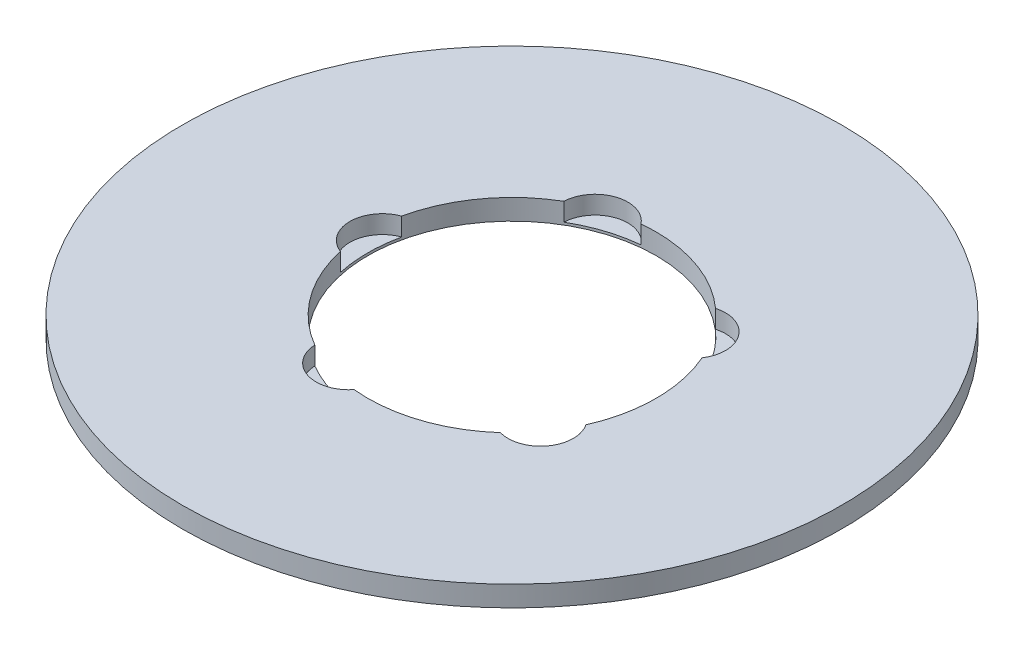
ISO-10303-21;
HEADER;
FILE_DESCRIPTION(('STEP AP214'),'2;1');
FILE_NAME('part.step','',(''),(''),'','','');
FILE_SCHEMA(('AUTOMOTIVE_DESIGN { 1 0 10303 214 1 1 1 1 }'));
ENDSEC;
DATA;
#1=APPLICATION_CONTEXT('core data for automotive mechanical design processes');
#2=APPLICATION_PROTOCOL_DEFINITION('international standard','automotive_design',2000,#1);
#3=PRODUCT_CONTEXT('',#1,'mechanical');
#4=PRODUCT('Part','Part','',(#3));
#5=PRODUCT_RELATED_PRODUCT_CATEGORY('part','',(#4));
#6=PRODUCT_DEFINITION_FORMATION('','',#4);
#7=PRODUCT_DEFINITION_CONTEXT('part definition',#1,'design');
#8=PRODUCT_DEFINITION('design','',#6,#7);
#9=PRODUCT_DEFINITION_SHAPE('','',#8);
#10=(LENGTH_UNIT() NAMED_UNIT(*) SI_UNIT(.MILLI.,.METRE.));
#11=(NAMED_UNIT(*) PLANE_ANGLE_UNIT() SI_UNIT($,.RADIAN.));
#12=(NAMED_UNIT(*) SI_UNIT($,.STERADIAN.) SOLID_ANGLE_UNIT());
#13=UNCERTAINTY_MEASURE_WITH_UNIT(LENGTH_MEASURE(1.E-05),#10,'distance_accuracy_value','');
#14=(GEOMETRIC_REPRESENTATION_CONTEXT(3) GLOBAL_UNCERTAINTY_ASSIGNED_CONTEXT((#13)) GLOBAL_UNIT_ASSIGNED_CONTEXT((#10,
#11,#12)) REPRESENTATION_CONTEXT('',''));
#15=CARTESIAN_POINT('',(0.,0.,0.));
#16=DIRECTION('',(0.,0.,1.));
#17=DIRECTION('',(1.,0.,0.));
#18=AXIS2_PLACEMENT_3D('',#15,#16,#17);
#19=CARTESIAN_POINT('',(0.,5.,0.));
#20=DIRECTION('',(0.,-1.,0.));
#21=DIRECTION('',(0.,0.,-1.));
#22=AXIS2_PLACEMENT_3D('',#19,#20,#21);
#23=CYLINDRICAL_SURFACE('',#22,80.);
#24=CARTESIAN_POINT('',(0.,5.,0.));
#25=DIRECTION('',(0.,1.,0.));
#26=DIRECTION('',(0.,0.,1.));
#27=AXIS2_PLACEMENT_3D('',#24,#25,#26);
#28=CIRCLE('',#27,80.);
#29=CARTESIAN_POINT('',(0.,5.,80.));
#30=VERTEX_POINT('',#29);
#31=EDGE_CURVE('E151',#30,#30,#28,.T.);
#32=ORIENTED_EDGE('',*,*,#31,.F.);
#33=EDGE_LOOP('',(#32));
#34=FACE_BOUND('',#33,.T.);
#35=CARTESIAN_POINT('',(0.,0.,0.));
#36=DIRECTION('',(0.,1.,0.));
#37=DIRECTION('',(0.,0.,1.));
#38=AXIS2_PLACEMENT_3D('',#35,#36,#37);
#39=CIRCLE('',#38,80.);
#40=CARTESIAN_POINT('',(0.,0.,80.));
#41=VERTEX_POINT('',#40);
#42=EDGE_CURVE('E150',#41,#41,#39,.T.);
#43=ORIENTED_EDGE('',*,*,#42,.T.);
#44=EDGE_LOOP('',(#43));
#45=FACE_BOUND('',#44,.T.);
#46=ADVANCED_FACE('F39',(#34,#45),#23,.T.);
#47=CARTESIAN_POINT('',(0.,5.,0.));
#48=DIRECTION('',(0.,1.,0.));
#49=DIRECTION('',(0.,0.,1.));
#50=AXIS2_PLACEMENT_3D('',#47,#48,#49);
#51=PLANE('',#50);
#52=CARTESIAN_POINT('',(-9.71646132065344,5.,-29.904193046174));
#53=DIRECTION('',(0.,1.,0.));
#54=DIRECTION('',(-0.95105651629515,0.,0.309016994374958));
#55=AXIS2_PLACEMENT_3D('',#52,#53,#54);
#56=CIRCLE('',#55,7.92707495473385);
#57=CARTESIAN_POINT('',(-3.50118381639631,5.,-34.8244413003828));
#58=VERTEX_POINT('',#57);
#59=CARTESIAN_POINT('',(-17.6367758077954,5.,-30.2315090444649));
#60=VERTEX_POINT('',#59);
#61=EDGE_CURVE('E196',#58,#60,#56,.T.);
#62=ORIENTED_EDGE('',*,*,#61,.F.);
#63=CARTESIAN_POINT('',(0.,5.,0.));
#64=DIRECTION('',(0.,1.,0.));
#65=DIRECTION('',(0.,0.,1.));
#66=AXIS2_PLACEMENT_3D('',#63,#64,#65);
#67=CIRCLE('',#66,35.);
#68=CARTESIAN_POINT('',(23.3018102235845,5.,-26.1156206187801));
#69=VERTEX_POINT('',#68);
#70=EDGE_CURVE('E156',#69,#58,#67,.T.);
#71=ORIENTED_EDGE('',*,*,#70,.F.);
#72=CARTESIAN_POINT('',(25.4380259878433,5.,-18.4818077086741));
#73=DIRECTION('',(0.,1.,0.));
#74=DIRECTION('',(-0.58778525229248,0.,-0.809016994374942));
#75=AXIS2_PLACEMENT_3D('',#72,#73,#74);
#76=CIRCLE('',#75,7.92707495473385);
#77=CARTESIAN_POINT('',(32.0380865253701,5.,-14.0911678647618));
#78=VERTEX_POINT('',#77);
#79=EDGE_CURVE('E254',#78,#69,#76,.T.);
#80=ORIENTED_EDGE('',*,*,#79,.F.);
#81=CARTESIAN_POINT('',(32.0380865253704,5.,14.0911678647614));
#82=VERTEX_POINT('',#81);
#83=EDGE_CURVE('E153',#82,#78,#67,.T.);
#84=ORIENTED_EDGE('',*,*,#83,.F.);
#85=CARTESIAN_POINT('',(25.4380259878436,5.,18.4818077086737));
#86=DIRECTION('',(0.,1.,0.));
#87=DIRECTION('',(0.587785252292469,0.,-0.809016994374951));
#88=AXIS2_PLACEMENT_3D('',#85,#86,#87);
#89=CIRCLE('',#88,7.92707495473385);
#90=CARTESIAN_POINT('',(23.3018102235849,5.,26.1156206187798));
#91=VERTEX_POINT('',#90);
#92=EDGE_CURVE('E248',#91,#82,#89,.T.);
#93=ORIENTED_EDGE('',*,*,#92,.F.);
#94=CARTESIAN_POINT('',(-3.50118381639581,5.,34.8244413003828));
#95=VERTEX_POINT('',#94);
#96=EDGE_CURVE('E140',#95,#91,#67,.T.);
#97=ORIENTED_EDGE('',*,*,#96,.F.);
#98=CARTESIAN_POINT('',(-9.71646132065301,5.,29.9041930461742));
#99=DIRECTION('',(0.,1.,0.));
#100=DIRECTION('',(0.951056516295155,0.,0.309016994374945));
#101=AXIS2_PLACEMENT_3D('',#98,#99,#100);
#102=CIRCLE('',#101,7.92707495473385);
#103=CARTESIAN_POINT('',(-17.636775807795,5.,30.2315090444651));
#104=VERTEX_POINT('',#103);
#105=EDGE_CURVE('E117',#104,#95,#102,.T.);
#106=ORIENTED_EDGE('',*,*,#105,.F.);
#107=CARTESIAN_POINT('',(-34.201937124764,5.,7.43152049810061));
#108=VERTEX_POINT('',#107);
#109=EDGE_CURVE('E133',#108,#104,#67,.T.);
#110=ORIENTED_EDGE('',*,*,#109,.F.);
#111=CARTESIAN_POINT('',(-31.4431293343808,5.,0.));
#112=DIRECTION('',(0.,1.,0.));
#113=DIRECTION('',(0.,0.,1.));
#114=AXIS2_PLACEMENT_3D('',#111,#112,#113);
#115=CIRCLE('',#114,7.92707495473385);
#116=CARTESIAN_POINT('',(-34.201937124764,5.,-7.43152049810061));
#117=VERTEX_POINT('',#116);
#118=EDGE_CURVE('E170',#117,#108,#115,.T.);
#119=ORIENTED_EDGE('',*,*,#118,.F.);
#120=EDGE_CURVE('E149',#60,#117,#67,.T.);
#121=ORIENTED_EDGE('',*,*,#120,.F.);
#122=EDGE_LOOP('',(#62,#71,#80,#84,#93,#97,#106,#110,#119,#121));
#123=FACE_BOUND('',#122,.T.);
#124=ORIENTED_EDGE('',*,*,#31,.T.);
#125=EDGE_LOOP('',(#124));
#126=FACE_BOUND('',#125,.T.);
#127=ADVANCED_FACE('F131',(#123,#126),#51,.T.);
#128=CARTESIAN_POINT('',(0.,0.,0.));
#129=DIRECTION('',(0.,1.,0.));
#130=DIRECTION('',(0.,0.,1.));
#131=AXIS2_PLACEMENT_3D('',#128,#129,#130);
#132=PLANE('',#131);
#133=CARTESIAN_POINT('',(0.,0.,0.));
#134=DIRECTION('',(0.,1.,0.));
#135=DIRECTION('',(0.,0.,1.));
#136=AXIS2_PLACEMENT_3D('',#133,#134,#135);
#137=CIRCLE('',#136,35.);
#138=CARTESIAN_POINT('',(0.,0.,35.));
#139=VERTEX_POINT('',#138);
#140=EDGE_CURVE('E160',#139,#139,#137,.T.);
#141=ORIENTED_EDGE('',*,*,#140,.T.);
#142=EDGE_LOOP('',(#141));
#143=FACE_BOUND('',#142,.T.);
#144=ORIENTED_EDGE('',*,*,#42,.F.);
#145=EDGE_LOOP('',(#144));
#146=FACE_BOUND('',#145,.T.);
#147=ADVANCED_FACE('F212',(#143,#146),#132,.F.);
#148=CARTESIAN_POINT('',(0.,5.,0.));
#149=DIRECTION('',(0.,-1.,0.));
#150=DIRECTION('',(0.,0.,-1.));
#151=AXIS2_PLACEMENT_3D('',#148,#149,#150);
#152=CYLINDRICAL_SURFACE('',#151,35.);
#153=DIRECTION('',(0.,1.,0.));
#154=VECTOR('',#153,1.);
#155=CARTESIAN_POINT('',(-3.50118381639631,2.80422740436709,-34.8244413003828));
#156=LINE('',#155,#154);
#157=CARTESIAN_POINT('',(-3.50118381639631,0.608454808734184,-34.8244413003828));
#158=VERTEX_POINT('',#157);
#159=EDGE_CURVE('E11',#158,#58,#156,.T.);
#160=ORIENTED_EDGE('',*,*,#159,.F.);
#161=CARTESIAN_POINT('',(0.,0.608454808734184,0.));
#162=DIRECTION('',(0.,1.,0.));
#163=DIRECTION('',(0.,0.,1.));
#164=AXIS2_PLACEMENT_3D('',#161,#162,#163);
#165=CIRCLE('',#164,35.);
#166=CARTESIAN_POINT('',(-17.6367758077954,0.608454808734184,-30.2315090444649));
#167=VERTEX_POINT('',#166);
#168=EDGE_CURVE('E193',#158,#167,#165,.T.);
#169=ORIENTED_EDGE('',*,*,#168,.T.);
#170=DIRECTION('',(0.,1.,0.));
#171=VECTOR('',#170,1.);
#172=CARTESIAN_POINT('',(-17.6367758077954,2.80422740436709,-30.2315090444649));
#173=LINE('',#172,#171);
#174=EDGE_CURVE('E46',#60,#167,#173,.F.);
#175=ORIENTED_EDGE('',*,*,#174,.F.);
#176=ORIENTED_EDGE('',*,*,#120,.T.);
#177=DIRECTION('',(0.,1.,0.));
#178=VECTOR('',#177,1.);
#179=CARTESIAN_POINT('',(-34.201937124764,2.80422740436709,-7.43152049810061));
#180=LINE('',#179,#178);
#181=CARTESIAN_POINT('',(-34.201937124764,0.608454808734184,-7.43152049810061));
#182=VERTEX_POINT('',#181);
#183=EDGE_CURVE('E174',#182,#117,#180,.T.);
#184=ORIENTED_EDGE('',*,*,#183,.F.);
#185=CARTESIAN_POINT('',(0.,0.608454808734184,0.));
#186=DIRECTION('',(0.,1.,0.));
#187=DIRECTION('',(0.,0.,1.));
#188=AXIS2_PLACEMENT_3D('',#185,#186,#187);
#189=CIRCLE('',#188,35.);
#190=CARTESIAN_POINT('',(-34.201937124764,0.608454808734184,7.43152049810061));
#191=VERTEX_POINT('',#190);
#192=EDGE_CURVE('E171',#182,#191,#189,.T.);
#193=ORIENTED_EDGE('',*,*,#192,.T.);
#194=DIRECTION('',(0.,1.,0.));
#195=VECTOR('',#194,1.);
#196=CARTESIAN_POINT('',(-34.201937124764,2.80422740436709,7.43152049810061));
#197=LINE('',#196,#195);
#198=EDGE_CURVE('E148',#108,#191,#197,.F.);
#199=ORIENTED_EDGE('',*,*,#198,.F.);
#200=ORIENTED_EDGE('',*,*,#109,.T.);
#201=DIRECTION('',(0.,1.,0.));
#202=VECTOR('',#201,1.);
#203=CARTESIAN_POINT('',(-17.636775807795,2.80422740436709,30.2315090444651));
#204=LINE('',#203,#202);
#205=CARTESIAN_POINT('',(-17.636775807795,0.608454808734184,30.2315090444651));
#206=VERTEX_POINT('',#205);
#207=EDGE_CURVE('E111',#206,#104,#204,.T.);
#208=ORIENTED_EDGE('',*,*,#207,.F.);
#209=CARTESIAN_POINT('',(0.,0.608454808734184,0.));
#210=DIRECTION('',(0.,1.,0.));
#211=DIRECTION('',(0.,0.,1.));
#212=AXIS2_PLACEMENT_3D('',#209,#210,#211);
#213=CIRCLE('',#212,35.);
#214=CARTESIAN_POINT('',(-3.50118381639581,0.608454808734184,34.8244413003828));
#215=VERTEX_POINT('',#214);
#216=EDGE_CURVE('E180',#206,#215,#213,.T.);
#217=ORIENTED_EDGE('',*,*,#216,.T.);
#218=DIRECTION('',(0.,1.,0.));
#219=VECTOR('',#218,1.);
#220=CARTESIAN_POINT('',(-3.50118381639582,2.80422740436709,34.8244413003828));
#221=LINE('',#220,#219);
#222=EDGE_CURVE('E124',#95,#215,#221,.F.);
#223=ORIENTED_EDGE('',*,*,#222,.F.);
#224=ORIENTED_EDGE('',*,*,#96,.T.);
#225=DIRECTION('',(0.,1.,0.));
#226=VECTOR('',#225,1.);
#227=CARTESIAN_POINT('',(23.3018102235849,2.80422740436709,26.1156206187798));
#228=LINE('',#227,#226);
#229=CARTESIAN_POINT('',(23.3018102235849,0.608454808734184,26.1156206187798));
#230=VERTEX_POINT('',#229);
#231=EDGE_CURVE('E183',#230,#91,#228,.T.);
#232=ORIENTED_EDGE('',*,*,#231,.F.);
#233=CARTESIAN_POINT('',(0.,0.608454808734184,0.));
#234=DIRECTION('',(0.,1.,0.));
#235=DIRECTION('',(0.,0.,1.));
#236=AXIS2_PLACEMENT_3D('',#233,#234,#235);
#237=CIRCLE('',#236,35.);
#238=CARTESIAN_POINT('',(32.0380865253704,0.608454808734184,14.0911678647614));
#239=VERTEX_POINT('',#238);
#240=EDGE_CURVE('E123',#230,#239,#237,.T.);
#241=ORIENTED_EDGE('',*,*,#240,.T.);
#242=DIRECTION('',(0.,1.,0.));
#243=VECTOR('',#242,1.);
#244=CARTESIAN_POINT('',(32.0380865253704,2.80422740436709,14.0911678647614));
#245=LINE('',#244,#243);
#246=EDGE_CURVE('E185',#82,#239,#245,.F.);
#247=ORIENTED_EDGE('',*,*,#246,.F.);
#248=ORIENTED_EDGE('',*,*,#83,.T.);
#249=DIRECTION('',(0.,1.,0.));
#250=VECTOR('',#249,1.);
#251=CARTESIAN_POINT('',(32.0380865253701,2.80422740436709,-14.0911678647618));
#252=LINE('',#251,#250);
#253=CARTESIAN_POINT('',(32.0380865253701,0.608454808734184,-14.0911678647618));
#254=VERTEX_POINT('',#253);
#255=EDGE_CURVE('E195',#254,#78,#252,.T.);
#256=ORIENTED_EDGE('',*,*,#255,.F.);
#257=CARTESIAN_POINT('',(0.,0.608454808734184,0.));
#258=DIRECTION('',(0.,1.,0.));
#259=DIRECTION('',(0.,0.,1.));
#260=AXIS2_PLACEMENT_3D('',#257,#258,#259);
#261=CIRCLE('',#260,35.);
#262=CARTESIAN_POINT('',(23.3018102235845,0.608454808734184,-26.1156206187801));
#263=VERTEX_POINT('',#262);
#264=EDGE_CURVE('E190',#254,#263,#261,.T.);
#265=ORIENTED_EDGE('',*,*,#264,.T.);
#266=DIRECTION('',(0.,1.,0.));
#267=VECTOR('',#266,1.);
#268=CARTESIAN_POINT('',(23.3018102235845,2.80422740436709,-26.1156206187801));
#269=LINE('',#268,#267);
#270=EDGE_CURVE('E189',#69,#263,#269,.F.);
#271=ORIENTED_EDGE('',*,*,#270,.F.);
#272=ORIENTED_EDGE('',*,*,#70,.T.);
#273=EDGE_LOOP('',(#160,#169,#175,#176,#184,#193,#199,#200,#208,#217,#223,#224,#232,#241,#247,
#248,#256,#265,#271,#272));
#274=FACE_BOUND('',#273,.T.);
#275=ORIENTED_EDGE('',*,*,#140,.F.);
#276=EDGE_LOOP('',(#275));
#277=FACE_BOUND('',#276,.T.);
#278=ADVANCED_FACE('F142',(#274,#277),#152,.F.);
#279=CARTESIAN_POINT('',(-31.4431293343808,0.608454808734184,0.));
#280=DIRECTION('',(0.,1.,0.));
#281=DIRECTION('',(0.,0.,1.));
#282=AXIS2_PLACEMENT_3D('',#279,#280,#281);
#283=CYLINDRICAL_SURFACE('',#282,7.92707495473385);
#284=ORIENTED_EDGE('',*,*,#183,.T.);
#285=ORIENTED_EDGE('',*,*,#118,.T.);
#286=ORIENTED_EDGE('',*,*,#198,.T.);
#287=CARTESIAN_POINT('',(-31.4431293343808,0.608454808734184,0.));
#288=DIRECTION('',(0.,1.,0.));
#289=DIRECTION('',(0.,0.,1.));
#290=AXIS2_PLACEMENT_3D('',#287,#288,#289);
#291=CIRCLE('',#290,7.92707495473385);
#292=EDGE_CURVE('E163',#182,#191,#291,.T.);
#293=ORIENTED_EDGE('',*,*,#292,.F.);
#294=EDGE_LOOP('',(#284,#285,#286,#293));
#295=FACE_BOUND('',#294,.T.);
#296=ADVANCED_FACE('F221',(#295),#283,.F.);
#297=CARTESIAN_POINT('',(-31.4431293343808,0.608454808734184,0.));
#298=DIRECTION('',(0.,1.,0.));
#299=DIRECTION('',(0.,0.,1.));
#300=AXIS2_PLACEMENT_3D('',#297,#298,#299);
#301=PLANE('',#300);
#302=ORIENTED_EDGE('',*,*,#292,.T.);
#303=ORIENTED_EDGE('',*,*,#192,.F.);
#304=EDGE_LOOP('',(#302,#303));
#305=FACE_BOUND('',#304,.T.);
#306=ADVANCED_FACE('F227',(#305),#301,.T.);
#307=CARTESIAN_POINT('',(-9.71646132065301,0.608454808734184,29.9041930461742));
#308=DIRECTION('',(0.,1.,0.));
#309=DIRECTION('',(0.,0.,1.));
#310=AXIS2_PLACEMENT_3D('',#307,#308,#309);
#311=CYLINDRICAL_SURFACE('',#310,7.92707495473385);
#312=ORIENTED_EDGE('',*,*,#207,.T.);
#313=ORIENTED_EDGE('',*,*,#105,.T.);
#314=ORIENTED_EDGE('',*,*,#222,.T.);
#315=CARTESIAN_POINT('',(-9.71646132065301,0.608454808734184,29.9041930461742));
#316=DIRECTION('',(0.,1.,0.));
#317=DIRECTION('',(0.951056516295155,0.,0.309016994374945));
#318=AXIS2_PLACEMENT_3D('',#315,#316,#317);
#319=CIRCLE('',#318,7.92707495473385);
#320=EDGE_CURVE('E119',#206,#215,#319,.T.);
#321=ORIENTED_EDGE('',*,*,#320,.F.);
#322=EDGE_LOOP('',(#312,#313,#314,#321));
#323=FACE_BOUND('',#322,.T.);
#324=ADVANCED_FACE('F116',(#323),#311,.F.);
#325=CARTESIAN_POINT('',(-9.71646132065301,0.608454808734184,29.9041930461742));
#326=DIRECTION('',(0.,1.,0.));
#327=DIRECTION('',(0.951056516295155,0.,0.309016994374945));
#328=AXIS2_PLACEMENT_3D('',#325,#326,#327);
#329=PLANE('',#328);
#330=ORIENTED_EDGE('',*,*,#320,.T.);
#331=ORIENTED_EDGE('',*,*,#216,.F.);
#332=EDGE_LOOP('',(#330,#331));
#333=FACE_BOUND('',#332,.T.);
#334=ADVANCED_FACE('F234',(#333),#329,.T.);
#335=CARTESIAN_POINT('',(25.4380259878436,0.608454808734184,18.4818077086737));
#336=DIRECTION('',(0.,1.,0.));
#337=DIRECTION('',(0.,0.,1.));
#338=AXIS2_PLACEMENT_3D('',#335,#336,#337);
#339=CYLINDRICAL_SURFACE('',#338,7.92707495473385);
#340=ORIENTED_EDGE('',*,*,#231,.T.);
#341=ORIENTED_EDGE('',*,*,#92,.T.);
#342=ORIENTED_EDGE('',*,*,#246,.T.);
#343=CARTESIAN_POINT('',(25.4380259878436,0.608454808734184,18.4818077086737));
#344=DIRECTION('',(0.,1.,0.));
#345=DIRECTION('',(0.587785252292469,0.,-0.809016994374951));
#346=AXIS2_PLACEMENT_3D('',#343,#344,#345);
#347=CIRCLE('',#346,7.92707495473385);
#348=EDGE_CURVE('E137',#230,#239,#347,.T.);
#349=ORIENTED_EDGE('',*,*,#348,.F.);
#350=EDGE_LOOP('',(#340,#341,#342,#349));
#351=FACE_BOUND('',#350,.T.);
#352=ADVANCED_FACE('F240',(#351),#339,.F.);
#353=CARTESIAN_POINT('',(25.4380259878436,0.608454808734184,18.4818077086737));
#354=DIRECTION('',(0.,1.,0.));
#355=DIRECTION('',(0.587785252292469,0.,-0.809016994374951));
#356=AXIS2_PLACEMENT_3D('',#353,#354,#355);
#357=PLANE('',#356);
#358=ORIENTED_EDGE('',*,*,#348,.T.);
#359=ORIENTED_EDGE('',*,*,#240,.F.);
#360=EDGE_LOOP('',(#358,#359));
#361=FACE_BOUND('',#360,.T.);
#362=ADVANCED_FACE('F245',(#361),#357,.T.);
#363=CARTESIAN_POINT('',(25.4380259878433,0.608454808734184,-18.4818077086741));
#364=DIRECTION('',(0.,1.,0.));
#365=DIRECTION('',(0.,0.,1.));
#366=AXIS2_PLACEMENT_3D('',#363,#364,#365);
#367=CYLINDRICAL_SURFACE('',#366,7.92707495473385);
#368=ORIENTED_EDGE('',*,*,#255,.T.);
#369=ORIENTED_EDGE('',*,*,#79,.T.);
#370=ORIENTED_EDGE('',*,*,#270,.T.);
#371=CARTESIAN_POINT('',(25.4380259878433,0.608454808734184,-18.4818077086741));
#372=DIRECTION('',(0.,1.,0.));
#373=DIRECTION('',(-0.58778525229248,0.,-0.809016994374942));
#374=AXIS2_PLACEMENT_3D('',#371,#372,#373);
#375=CIRCLE('',#374,7.92707495473385);
#376=EDGE_CURVE('E56',#254,#263,#375,.T.);
#377=ORIENTED_EDGE('',*,*,#376,.F.);
#378=EDGE_LOOP('',(#368,#369,#370,#377));
#379=FACE_BOUND('',#378,.T.);
#380=ADVANCED_FACE('F264',(#379),#367,.F.);
#381=CARTESIAN_POINT('',(25.4380259878433,0.608454808734184,-18.4818077086741));
#382=DIRECTION('',(0.,1.,0.));
#383=DIRECTION('',(-0.58778525229248,0.,-0.809016994374942));
#384=AXIS2_PLACEMENT_3D('',#381,#382,#383);
#385=PLANE('',#384);
#386=ORIENTED_EDGE('',*,*,#376,.T.);
#387=ORIENTED_EDGE('',*,*,#264,.F.);
#388=EDGE_LOOP('',(#386,#387));
#389=FACE_BOUND('',#388,.T.);
#390=ADVANCED_FACE('F202',(#389),#385,.T.);
#391=CARTESIAN_POINT('',(-9.71646132065344,0.608454808734184,-29.904193046174));
#392=DIRECTION('',(0.,1.,0.));
#393=DIRECTION('',(0.,0.,1.));
#394=AXIS2_PLACEMENT_3D('',#391,#392,#393);
#395=CYLINDRICAL_SURFACE('',#394,7.92707495473385);
#396=ORIENTED_EDGE('',*,*,#159,.T.);
#397=ORIENTED_EDGE('',*,*,#61,.T.);
#398=ORIENTED_EDGE('',*,*,#174,.T.);
#399=CARTESIAN_POINT('',(-9.71646132065344,0.608454808734184,-29.904193046174));
#400=DIRECTION('',(0.,1.,0.));
#401=DIRECTION('',(-0.95105651629515,0.,0.309016994374958));
#402=AXIS2_PLACEMENT_3D('',#399,#400,#401);
#403=CIRCLE('',#402,7.92707495473385);
#404=EDGE_CURVE('E55',#158,#167,#403,.T.);
#405=ORIENTED_EDGE('',*,*,#404,.F.);
#406=EDGE_LOOP('',(#396,#397,#398,#405));
#407=FACE_BOUND('',#406,.T.);
#408=ADVANCED_FACE('F197',(#407),#395,.F.);
#409=CARTESIAN_POINT('',(-9.71646132065344,0.608454808734184,-29.904193046174));
#410=DIRECTION('',(0.,1.,0.));
#411=DIRECTION('',(-0.95105651629515,0.,0.309016994374958));
#412=AXIS2_PLACEMENT_3D('',#409,#410,#411);
#413=PLANE('',#412);
#414=ORIENTED_EDGE('',*,*,#404,.T.);
#415=ORIENTED_EDGE('',*,*,#168,.F.);
#416=EDGE_LOOP('',(#414,#415));
#417=FACE_BOUND('',#416,.T.);
#418=ADVANCED_FACE('F200',(#417),#413,.T.);
#419=CLOSED_SHELL('',(#46,#127,#147,#278,#296,#306,#324,#334,#352,#362,#380,#390,#408,#418));
#420=MANIFOLD_SOLID_BREP('B2',#419);
#421=ADVANCED_BREP_SHAPE_REPRESENTATION('',(#18,#420),#14);
#422=SHAPE_DEFINITION_REPRESENTATION(#9,#421);
ENDSEC;
END-ISO-10303-21;
